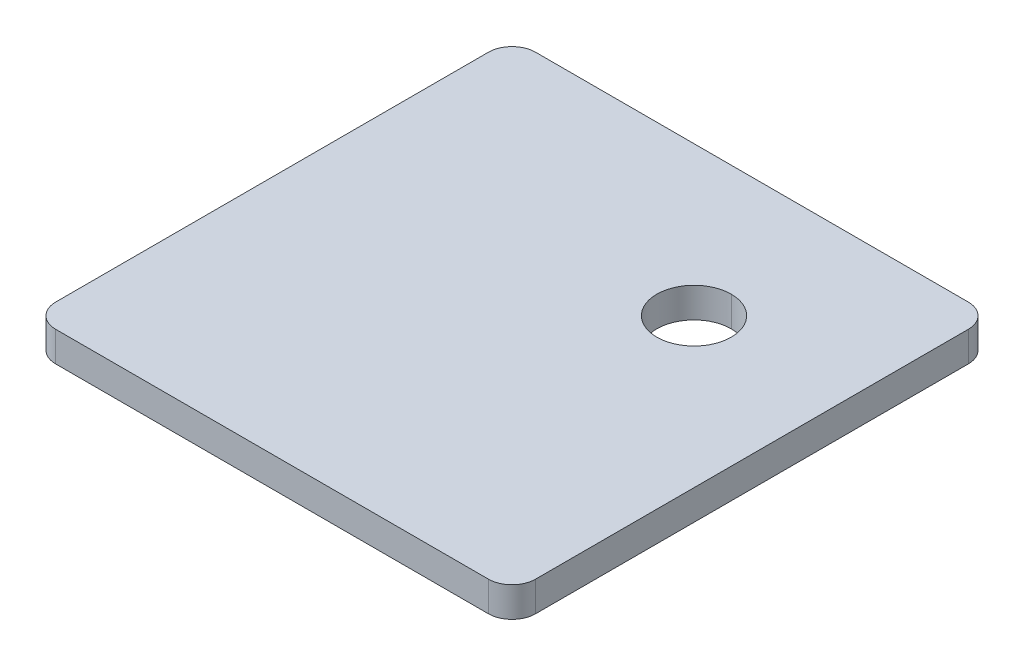
ISO-10303-21;
HEADER;
FILE_DESCRIPTION(('STEP AP214'),'2;1');
FILE_NAME('part.step','',(''),(''),'','','');
FILE_SCHEMA(('AUTOMOTIVE_DESIGN { 1 0 10303 214 1 1 1 1 }'));
ENDSEC;
DATA;
#1=APPLICATION_CONTEXT('core data for automotive mechanical design processes');
#2=APPLICATION_PROTOCOL_DEFINITION('international standard','automotive_design',2000,#1);
#3=PRODUCT_CONTEXT('',#1,'mechanical');
#4=PRODUCT('Part','Part','',(#3));
#5=PRODUCT_RELATED_PRODUCT_CATEGORY('part','',(#4));
#6=PRODUCT_DEFINITION_FORMATION('','',#4);
#7=PRODUCT_DEFINITION_CONTEXT('part definition',#1,'design');
#8=PRODUCT_DEFINITION('design','',#6,#7);
#9=PRODUCT_DEFINITION_SHAPE('','',#8);
#10=(LENGTH_UNIT() NAMED_UNIT(*) SI_UNIT(.MILLI.,.METRE.));
#11=(NAMED_UNIT(*) PLANE_ANGLE_UNIT() SI_UNIT($,.RADIAN.));
#12=(NAMED_UNIT(*) SI_UNIT($,.STERADIAN.) SOLID_ANGLE_UNIT());
#13=UNCERTAINTY_MEASURE_WITH_UNIT(LENGTH_MEASURE(1.E-05),#10,'distance_accuracy_value','');
#14=(GEOMETRIC_REPRESENTATION_CONTEXT(3) GLOBAL_UNCERTAINTY_ASSIGNED_CONTEXT((#13)) GLOBAL_UNIT_ASSIGNED_CONTEXT((#10,
#11,#12)) REPRESENTATION_CONTEXT('',''));
#15=CARTESIAN_POINT('',(0.,0.,0.));
#16=DIRECTION('',(0.,0.,1.));
#17=DIRECTION('',(1.,0.,0.));
#18=AXIS2_PLACEMENT_3D('',#15,#16,#17);
#19=CARTESIAN_POINT('',(38.5,-12.7,-38.5));
#20=DIRECTION('',(0.,1.,0.));
#21=DIRECTION('',(0.,0.,1.));
#22=AXIS2_PLACEMENT_3D('',#19,#20,#21);
#23=CYLINDRICAL_SURFACE('',#22,15.75);
#24=DIRECTION('',(0.,1.,0.));
#25=VECTOR('',#24,1.);
#26=CARTESIAN_POINT('',(38.5,-12.7,-54.25));
#27=LINE('',#26,#25);
#28=CARTESIAN_POINT('',(38.5,-12.7,-54.25));
#29=VERTEX_POINT('',#28);
#30=CARTESIAN_POINT('',(38.5,0.,-54.25));
#31=VERTEX_POINT('',#30);
#32=EDGE_CURVE('E156',#29,#31,#27,.T.);
#33=ORIENTED_EDGE('',*,*,#32,.F.);
#34=CARTESIAN_POINT('',(38.5,-12.7,-38.5));
#35=DIRECTION('',(0.,1.,0.));
#36=DIRECTION('',(0.,0.,1.));
#37=AXIS2_PLACEMENT_3D('',#34,#35,#36);
#38=CIRCLE('',#37,15.75);
#39=CARTESIAN_POINT('',(38.5,-12.7,-22.75));
#40=VERTEX_POINT('',#39);
#41=EDGE_CURVE('E28',#40,#29,#38,.T.);
#42=ORIENTED_EDGE('',*,*,#41,.F.);
#43=DIRECTION('',(0.,1.,0.));
#44=VECTOR('',#43,1.);
#45=CARTESIAN_POINT('',(38.5,-12.7,-22.75));
#46=LINE('',#45,#44);
#47=CARTESIAN_POINT('',(38.5,0.,-22.75));
#48=VERTEX_POINT('',#47);
#49=EDGE_CURVE('E155',#40,#48,#46,.T.);
#50=ORIENTED_EDGE('',*,*,#49,.T.);
#51=CARTESIAN_POINT('',(38.5,0.,-38.5));
#52=DIRECTION('',(0.,1.,0.));
#53=DIRECTION('',(0.,0.,1.));
#54=AXIS2_PLACEMENT_3D('',#51,#52,#53);
#55=CIRCLE('',#54,15.75);
#56=EDGE_CURVE('E11',#48,#31,#55,.T.);
#57=ORIENTED_EDGE('',*,*,#56,.T.);
#58=EDGE_LOOP('',(#33,#42,#50,#57));
#59=FACE_BOUND('',#58,.T.);
#60=ADVANCED_FACE('F17',(#59),#23,.F.);
#61=CARTESIAN_POINT('',(-91.5,0.,91.5));
#62=DIRECTION('',(0.,1.,0.));
#63=DIRECTION('',(1.,0.,0.));
#64=AXIS2_PLACEMENT_3D('',#61,#62,#63);
#65=PLANE('',#64);
#66=ORIENTED_EDGE('',*,*,#56,.F.);
#67=CARTESIAN_POINT('',(38.5,0.,-38.5));
#68=DIRECTION('',(0.,1.,0.));
#69=DIRECTION('',(0.,0.,1.));
#70=AXIS2_PLACEMENT_3D('',#67,#68,#69);
#71=CIRCLE('',#70,15.75);
#72=EDGE_CURVE('E152',#31,#48,#71,.T.);
#73=ORIENTED_EDGE('',*,*,#72,.F.);
#74=EDGE_LOOP('',(#66,#73));
#75=FACE_BOUND('',#74,.T.);
#76=CARTESIAN_POINT('',(-91.5,0.,91.5));
#77=DIRECTION('',(0.,1.,0.));
#78=DIRECTION('',(0.,0.,1.));
#79=AXIS2_PLACEMENT_3D('',#76,#77,#78);
#80=CIRCLE('',#79,10.);
#81=CARTESIAN_POINT('',(-101.5,0.,91.5));
#82=VERTEX_POINT('',#81);
#83=CARTESIAN_POINT('',(-91.5,0.,101.5));
#84=VERTEX_POINT('',#83);
#85=EDGE_CURVE('E165',#82,#84,#80,.T.);
#86=ORIENTED_EDGE('',*,*,#85,.T.);
#87=DIRECTION('',(1.,0.,0.));
#88=VECTOR('',#87,1.);
#89=CARTESIAN_POINT('',(-91.5,0.,101.5));
#90=LINE('',#89,#88);
#91=CARTESIAN_POINT('',(91.5,0.,101.5));
#92=VERTEX_POINT('',#91);
#93=EDGE_CURVE('E173',#84,#92,#90,.T.);
#94=ORIENTED_EDGE('',*,*,#93,.T.);
#95=CARTESIAN_POINT('',(91.5,0.,91.5));
#96=DIRECTION('',(0.,1.,0.));
#97=DIRECTION('',(0.,0.,1.));
#98=AXIS2_PLACEMENT_3D('',#95,#96,#97);
#99=CIRCLE('',#98,10.);
#100=CARTESIAN_POINT('',(101.5,0.,91.5));
#101=VERTEX_POINT('',#100);
#102=EDGE_CURVE('E107',#92,#101,#99,.T.);
#103=ORIENTED_EDGE('',*,*,#102,.T.);
#104=DIRECTION('',(0.,0.,-1.));
#105=VECTOR('',#104,1.);
#106=CARTESIAN_POINT('',(101.5,0.,91.5));
#107=LINE('',#106,#105);
#108=CARTESIAN_POINT('',(101.5,0.,-91.5));
#109=VERTEX_POINT('',#108);
#110=EDGE_CURVE('E140',#101,#109,#107,.T.);
#111=ORIENTED_EDGE('',*,*,#110,.T.);
#112=CARTESIAN_POINT('',(91.5,0.,-91.5));
#113=DIRECTION('',(0.,1.,0.));
#114=DIRECTION('',(0.,0.,1.));
#115=AXIS2_PLACEMENT_3D('',#112,#113,#114);
#116=CIRCLE('',#115,10.);
#117=CARTESIAN_POINT('',(91.5,0.,-101.5));
#118=VERTEX_POINT('',#117);
#119=EDGE_CURVE('E143',#109,#118,#116,.T.);
#120=ORIENTED_EDGE('',*,*,#119,.T.);
#121=DIRECTION('',(-1.,0.,0.));
#122=VECTOR('',#121,1.);
#123=CARTESIAN_POINT('',(-91.5,0.,-101.5));
#124=LINE('',#123,#122);
#125=CARTESIAN_POINT('',(-91.5,0.,-101.5));
#126=VERTEX_POINT('',#125);
#127=EDGE_CURVE('E157',#118,#126,#124,.T.);
#128=ORIENTED_EDGE('',*,*,#127,.T.);
#129=CARTESIAN_POINT('',(-91.5,0.,-91.5));
#130=DIRECTION('',(0.,1.,0.));
#131=DIRECTION('',(0.,0.,-1.));
#132=AXIS2_PLACEMENT_3D('',#129,#130,#131);
#133=CIRCLE('',#132,10.);
#134=CARTESIAN_POINT('',(-101.5,0.,-91.5));
#135=VERTEX_POINT('',#134);
#136=EDGE_CURVE('E63',#126,#135,#133,.T.);
#137=ORIENTED_EDGE('',*,*,#136,.T.);
#138=DIRECTION('',(0.,0.,1.));
#139=VECTOR('',#138,1.);
#140=CARTESIAN_POINT('',(-101.5,0.,91.5));
#141=LINE('',#140,#139);
#142=EDGE_CURVE('E21',#135,#82,#141,.T.);
#143=ORIENTED_EDGE('',*,*,#142,.T.);
#144=EDGE_LOOP('',(#86,#94,#103,#111,#120,#128,#137,#143));
#145=FACE_BOUND('',#144,.T.);
#146=ADVANCED_FACE('F276',(#75,#145),#65,.T.);
#147=CARTESIAN_POINT('',(-91.5,-12.7,91.5));
#148=DIRECTION('',(0.,1.,0.));
#149=DIRECTION('',(1.,0.,0.));
#150=AXIS2_PLACEMENT_3D('',#147,#148,#149);
#151=PLANE('',#150);
#152=ORIENTED_EDGE('',*,*,#41,.T.);
#153=CARTESIAN_POINT('',(38.5,-12.7,-38.5));
#154=DIRECTION('',(0.,1.,0.));
#155=DIRECTION('',(0.,0.,1.));
#156=AXIS2_PLACEMENT_3D('',#153,#154,#155);
#157=CIRCLE('',#156,15.75);
#158=EDGE_CURVE('E177',#29,#40,#157,.T.);
#159=ORIENTED_EDGE('',*,*,#158,.T.);
#160=EDGE_LOOP('',(#152,#159));
#161=FACE_BOUND('',#160,.T.);
#162=CARTESIAN_POINT('',(-91.5,-12.7,91.5));
#163=DIRECTION('',(0.,1.,0.));
#164=DIRECTION('',(0.,0.,1.));
#165=AXIS2_PLACEMENT_3D('',#162,#163,#164);
#166=CIRCLE('',#165,10.);
#167=CARTESIAN_POINT('',(-101.5,-12.7,91.5));
#168=VERTEX_POINT('',#167);
#169=CARTESIAN_POINT('',(-91.5,-12.7,101.5));
#170=VERTEX_POINT('',#169);
#171=EDGE_CURVE('E190',#168,#170,#166,.T.);
#172=ORIENTED_EDGE('',*,*,#171,.F.);
#173=DIRECTION('',(0.,0.,1.));
#174=VECTOR('',#173,1.);
#175=CARTESIAN_POINT('',(-101.5,-12.7,91.5));
#176=LINE('',#175,#174);
#177=CARTESIAN_POINT('',(-101.5,-12.7,-91.5));
#178=VERTEX_POINT('',#177);
#179=EDGE_CURVE('E200',#178,#168,#176,.T.);
#180=ORIENTED_EDGE('',*,*,#179,.F.);
#181=CARTESIAN_POINT('',(-91.5,-12.7,-91.5));
#182=DIRECTION('',(0.,1.,0.));
#183=DIRECTION('',(0.,0.,-1.));
#184=AXIS2_PLACEMENT_3D('',#181,#182,#183);
#185=CIRCLE('',#184,10.);
#186=CARTESIAN_POINT('',(-91.5,-12.7,-101.5));
#187=VERTEX_POINT('',#186);
#188=EDGE_CURVE('E161',#187,#178,#185,.T.);
#189=ORIENTED_EDGE('',*,*,#188,.F.);
#190=DIRECTION('',(-1.,0.,0.));
#191=VECTOR('',#190,1.);
#192=CARTESIAN_POINT('',(-91.5,-12.7,-101.5));
#193=LINE('',#192,#191);
#194=CARTESIAN_POINT('',(91.5,-12.7,-101.5));
#195=VERTEX_POINT('',#194);
#196=EDGE_CURVE('E135',#195,#187,#193,.T.);
#197=ORIENTED_EDGE('',*,*,#196,.F.);
#198=CARTESIAN_POINT('',(91.5,-12.7,-91.5));
#199=DIRECTION('',(0.,1.,0.));
#200=DIRECTION('',(0.,0.,1.));
#201=AXIS2_PLACEMENT_3D('',#198,#199,#200);
#202=CIRCLE('',#201,10.);
#203=CARTESIAN_POINT('',(101.5,-12.7,-91.5));
#204=VERTEX_POINT('',#203);
#205=EDGE_CURVE('E132',#204,#195,#202,.T.);
#206=ORIENTED_EDGE('',*,*,#205,.F.);
#207=DIRECTION('',(0.,0.,-1.));
#208=VECTOR('',#207,1.);
#209=CARTESIAN_POINT('',(101.5,-12.7,91.5));
#210=LINE('',#209,#208);
#211=CARTESIAN_POINT('',(101.5,-12.7,91.5));
#212=VERTEX_POINT('',#211);
#213=EDGE_CURVE('E120',#212,#204,#210,.T.);
#214=ORIENTED_EDGE('',*,*,#213,.F.);
#215=CARTESIAN_POINT('',(91.5,-12.7,91.5));
#216=DIRECTION('',(0.,1.,0.));
#217=DIRECTION('',(0.,0.,1.));
#218=AXIS2_PLACEMENT_3D('',#215,#216,#217);
#219=CIRCLE('',#218,10.);
#220=CARTESIAN_POINT('',(91.5,-12.7,101.5));
#221=VERTEX_POINT('',#220);
#222=EDGE_CURVE('E194',#221,#212,#219,.T.);
#223=ORIENTED_EDGE('',*,*,#222,.F.);
#224=DIRECTION('',(1.,0.,0.));
#225=VECTOR('',#224,1.);
#226=CARTESIAN_POINT('',(-91.5,-12.7,101.5));
#227=LINE('',#226,#225);
#228=EDGE_CURVE('E43',#170,#221,#227,.T.);
#229=ORIENTED_EDGE('',*,*,#228,.F.);
#230=EDGE_LOOP('',(#172,#180,#189,#197,#206,#214,#223,#229));
#231=FACE_BOUND('',#230,.T.);
#232=ADVANCED_FACE('F133',(#161,#231),#151,.F.);
#233=CARTESIAN_POINT('',(-91.5,-12.7,101.5));
#234=DIRECTION('',(0.,0.,1.));
#235=DIRECTION('',(1.,0.,0.));
#236=AXIS2_PLACEMENT_3D('',#233,#234,#235);
#237=PLANE('',#236);
#238=ORIENTED_EDGE('',*,*,#93,.F.);
#239=DIRECTION('',(0.,1.,0.));
#240=VECTOR('',#239,1.);
#241=CARTESIAN_POINT('',(-91.5,-12.7,101.5));
#242=LINE('',#241,#240);
#243=EDGE_CURVE('E186',#170,#84,#242,.T.);
#244=ORIENTED_EDGE('',*,*,#243,.F.);
#245=ORIENTED_EDGE('',*,*,#228,.T.);
#246=DIRECTION('',(0.,1.,0.));
#247=VECTOR('',#246,1.);
#248=CARTESIAN_POINT('',(91.5,-12.7,101.5));
#249=LINE('',#248,#247);
#250=EDGE_CURVE('E191',#221,#92,#249,.T.);
#251=ORIENTED_EDGE('',*,*,#250,.T.);
#252=EDGE_LOOP('',(#238,#244,#245,#251));
#253=FACE_BOUND('',#252,.T.);
#254=ADVANCED_FACE('F242',(#253),#237,.T.);
#255=CARTESIAN_POINT('',(91.5,-12.7,91.5));
#256=DIRECTION('',(0.,1.,0.));
#257=DIRECTION('',(0.,0.,1.));
#258=AXIS2_PLACEMENT_3D('',#255,#256,#257);
#259=CYLINDRICAL_SURFACE('',#258,10.);
#260=ORIENTED_EDGE('',*,*,#102,.F.);
#261=ORIENTED_EDGE('',*,*,#250,.F.);
#262=ORIENTED_EDGE('',*,*,#222,.T.);
#263=DIRECTION('',(0.,1.,0.));
#264=VECTOR('',#263,1.);
#265=CARTESIAN_POINT('',(101.5,-12.7,91.5));
#266=LINE('',#265,#264);
#267=EDGE_CURVE('E127',#212,#101,#266,.T.);
#268=ORIENTED_EDGE('',*,*,#267,.T.);
#269=EDGE_LOOP('',(#260,#261,#262,#268));
#270=FACE_BOUND('',#269,.T.);
#271=ADVANCED_FACE('F237',(#270),#259,.T.);
#272=CARTESIAN_POINT('',(101.5,-12.7,91.5));
#273=DIRECTION('',(1.,0.,0.));
#274=DIRECTION('',(0.,0.,-1.));
#275=AXIS2_PLACEMENT_3D('',#272,#273,#274);
#276=PLANE('',#275);
#277=ORIENTED_EDGE('',*,*,#110,.F.);
#278=ORIENTED_EDGE('',*,*,#267,.F.);
#279=ORIENTED_EDGE('',*,*,#213,.T.);
#280=DIRECTION('',(0.,1.,0.));
#281=VECTOR('',#280,1.);
#282=CARTESIAN_POINT('',(101.5,-12.7,-91.5));
#283=LINE('',#282,#281);
#284=EDGE_CURVE('E125',#204,#109,#283,.T.);
#285=ORIENTED_EDGE('',*,*,#284,.T.);
#286=EDGE_LOOP('',(#277,#278,#279,#285));
#287=FACE_BOUND('',#286,.T.);
#288=ADVANCED_FACE('F123',(#287),#276,.T.);
#289=CARTESIAN_POINT('',(91.5,-12.7,-91.5));
#290=DIRECTION('',(0.,1.,0.));
#291=DIRECTION('',(0.,0.,1.));
#292=AXIS2_PLACEMENT_3D('',#289,#290,#291);
#293=CYLINDRICAL_SURFACE('',#292,10.);
#294=ORIENTED_EDGE('',*,*,#119,.F.);
#295=ORIENTED_EDGE('',*,*,#284,.F.);
#296=ORIENTED_EDGE('',*,*,#205,.T.);
#297=DIRECTION('',(0.,1.,0.));
#298=VECTOR('',#297,1.);
#299=CARTESIAN_POINT('',(91.5,-12.7,-101.5));
#300=LINE('',#299,#298);
#301=EDGE_CURVE('E160',#195,#118,#300,.T.);
#302=ORIENTED_EDGE('',*,*,#301,.T.);
#303=EDGE_LOOP('',(#294,#295,#296,#302));
#304=FACE_BOUND('',#303,.T.);
#305=ADVANCED_FACE('F142',(#304),#293,.T.);
#306=CARTESIAN_POINT('',(-91.5,-12.7,-101.5));
#307=DIRECTION('',(0.,0.,-1.));
#308=DIRECTION('',(-1.,0.,0.));
#309=AXIS2_PLACEMENT_3D('',#306,#307,#308);
#310=PLANE('',#309);
#311=ORIENTED_EDGE('',*,*,#127,.F.);
#312=ORIENTED_EDGE('',*,*,#301,.F.);
#313=ORIENTED_EDGE('',*,*,#196,.T.);
#314=DIRECTION('',(0.,1.,0.));
#315=VECTOR('',#314,1.);
#316=CARTESIAN_POINT('',(-91.5,-12.7,-101.5));
#317=LINE('',#316,#315);
#318=EDGE_CURVE('E164',#187,#126,#317,.T.);
#319=ORIENTED_EDGE('',*,*,#318,.T.);
#320=EDGE_LOOP('',(#311,#312,#313,#319));
#321=FACE_BOUND('',#320,.T.);
#322=ADVANCED_FACE('F301',(#321),#310,.T.);
#323=CARTESIAN_POINT('',(-91.5,-12.7,-91.5));
#324=DIRECTION('',(0.,1.,0.));
#325=DIRECTION('',(0.,0.,1.));
#326=AXIS2_PLACEMENT_3D('',#323,#324,#325);
#327=CYLINDRICAL_SURFACE('',#326,10.);
#328=ORIENTED_EDGE('',*,*,#136,.F.);
#329=ORIENTED_EDGE('',*,*,#318,.F.);
#330=ORIENTED_EDGE('',*,*,#188,.T.);
#331=DIRECTION('',(0.,1.,0.));
#332=VECTOR('',#331,1.);
#333=CARTESIAN_POINT('',(-101.5,-12.7,-91.5));
#334=LINE('',#333,#332);
#335=EDGE_CURVE('E203',#178,#135,#334,.T.);
#336=ORIENTED_EDGE('',*,*,#335,.T.);
#337=EDGE_LOOP('',(#328,#329,#330,#336));
#338=FACE_BOUND('',#337,.T.);
#339=ADVANCED_FACE('F314',(#338),#327,.T.);
#340=CARTESIAN_POINT('',(-101.5,-12.7,91.5));
#341=DIRECTION('',(-1.,0.,0.));
#342=DIRECTION('',(0.,0.,1.));
#343=AXIS2_PLACEMENT_3D('',#340,#341,#342);
#344=PLANE('',#343);
#345=ORIENTED_EDGE('',*,*,#142,.F.);
#346=ORIENTED_EDGE('',*,*,#335,.F.);
#347=ORIENTED_EDGE('',*,*,#179,.T.);
#348=DIRECTION('',(0.,1.,0.));
#349=VECTOR('',#348,1.);
#350=CARTESIAN_POINT('',(-101.5,-12.7,91.5));
#351=LINE('',#350,#349);
#352=EDGE_CURVE('E169',#168,#82,#351,.T.);
#353=ORIENTED_EDGE('',*,*,#352,.T.);
#354=EDGE_LOOP('',(#345,#346,#347,#353));
#355=FACE_BOUND('',#354,.T.);
#356=ADVANCED_FACE('F309',(#355),#344,.T.);
#357=CARTESIAN_POINT('',(-91.5,-12.7,91.5));
#358=DIRECTION('',(0.,1.,0.));
#359=DIRECTION('',(0.,0.,1.));
#360=AXIS2_PLACEMENT_3D('',#357,#358,#359);
#361=CYLINDRICAL_SURFACE('',#360,10.);
#362=ORIENTED_EDGE('',*,*,#85,.F.);
#363=ORIENTED_EDGE('',*,*,#352,.F.);
#364=ORIENTED_EDGE('',*,*,#171,.T.);
#365=ORIENTED_EDGE('',*,*,#243,.T.);
#366=EDGE_LOOP('',(#362,#363,#364,#365));
#367=FACE_BOUND('',#366,.T.);
#368=ADVANCED_FACE('F19',(#367),#361,.T.);
#369=CARTESIAN_POINT('',(38.5,-12.7,-38.5));
#370=DIRECTION('',(0.,1.,0.));
#371=DIRECTION('',(0.,0.,1.));
#372=AXIS2_PLACEMENT_3D('',#369,#370,#371);
#373=CYLINDRICAL_SURFACE('',#372,15.75);
#374=ORIENTED_EDGE('',*,*,#158,.F.);
#375=ORIENTED_EDGE('',*,*,#32,.T.);
#376=ORIENTED_EDGE('',*,*,#72,.T.);
#377=ORIENTED_EDGE('',*,*,#49,.F.);
#378=EDGE_LOOP('',(#374,#375,#376,#377));
#379=FACE_BOUND('',#378,.T.);
#380=ADVANCED_FACE('F285',(#379),#373,.F.);
#381=CLOSED_SHELL('',(#60,#146,#232,#254,#271,#288,#305,#322,#339,#356,#368,#380));
#382=MANIFOLD_SOLID_BREP('B1',#381);
#383=ADVANCED_BREP_SHAPE_REPRESENTATION('',(#18,#382),#14);
#384=SHAPE_DEFINITION_REPRESENTATION(#9,#383);
ENDSEC;
END-ISO-10303-21;
